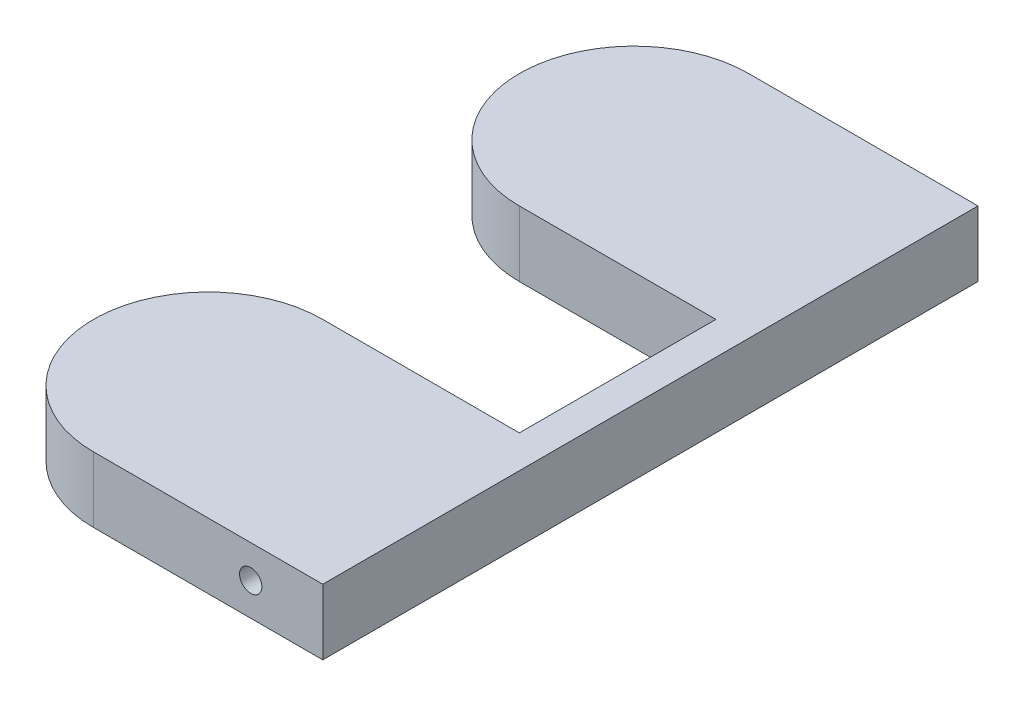
ISO-10303-21;
HEADER;
FILE_DESCRIPTION(('STEP AP214'),'2;1');
FILE_NAME('part.step','',(''),(''),'','','');
FILE_SCHEMA(('AUTOMOTIVE_DESIGN { 1 0 10303 214 1 1 1 1 }'));
ENDSEC;
DATA;
#1=APPLICATION_CONTEXT('core data for automotive mechanical design processes');
#2=APPLICATION_PROTOCOL_DEFINITION('international standard','automotive_design',2000,#1);
#3=PRODUCT_CONTEXT('',#1,'mechanical');
#4=PRODUCT('Part','Part','',(#3));
#5=PRODUCT_RELATED_PRODUCT_CATEGORY('part','',(#4));
#6=PRODUCT_DEFINITION_FORMATION('','',#4);
#7=PRODUCT_DEFINITION_CONTEXT('part definition',#1,'design');
#8=PRODUCT_DEFINITION('design','',#6,#7);
#9=PRODUCT_DEFINITION_SHAPE('','',#8);
#10=(LENGTH_UNIT() NAMED_UNIT(*) SI_UNIT(.MILLI.,.METRE.));
#11=(NAMED_UNIT(*) PLANE_ANGLE_UNIT() SI_UNIT($,.RADIAN.));
#12=(NAMED_UNIT(*) SI_UNIT($,.STERADIAN.) SOLID_ANGLE_UNIT());
#13=UNCERTAINTY_MEASURE_WITH_UNIT(LENGTH_MEASURE(1.E-05),#10,'distance_accuracy_value','');
#14=(GEOMETRIC_REPRESENTATION_CONTEXT(3) GLOBAL_UNCERTAINTY_ASSIGNED_CONTEXT((#13)) GLOBAL_UNIT_ASSIGNED_CONTEXT((#10,
#11,#12)) REPRESENTATION_CONTEXT('',''));
#15=CARTESIAN_POINT('',(0.,0.,0.));
#16=DIRECTION('',(0.,0.,1.));
#17=DIRECTION('',(1.,0.,0.));
#18=AXIS2_PLACEMENT_3D('',#15,#16,#17);
#19=CARTESIAN_POINT('',(-30.,0.,32.5));
#20=DIRECTION('',(0.,-1.,0.));
#21=DIRECTION('',(0.,0.,-1.));
#22=AXIS2_PLACEMENT_3D('',#19,#20,#21);
#23=PLANE('',#22);
#24=DIRECTION('',(1.,0.,0.));
#25=VECTOR('',#24,1.);
#26=CARTESIAN_POINT('',(5.00000000000001,0.,50.));
#27=LINE('',#26,#25);
#28=CARTESIAN_POINT('',(-30.,0.,50.));
#29=VERTEX_POINT('',#28);
#30=CARTESIAN_POINT('',(5.00000000000001,0.,50.));
#31=VERTEX_POINT('',#30);
#32=EDGE_CURVE('E216',#29,#31,#27,.T.);
#33=ORIENTED_EDGE('',*,*,#32,.F.);
#34=CARTESIAN_POINT('',(-30.,0.,32.5));
#35=DIRECTION('',(0.,1.,0.));
#36=DIRECTION('',(0.,0.,-1.));
#37=AXIS2_PLACEMENT_3D('',#34,#35,#36);
#38=CIRCLE('',#37,17.5);
#39=CARTESIAN_POINT('',(-30.,0.,15.));
#40=VERTEX_POINT('',#39);
#41=EDGE_CURVE('E221',#40,#29,#38,.T.);
#42=ORIENTED_EDGE('',*,*,#41,.F.);
#43=DIRECTION('',(-1.,0.,0.));
#44=VECTOR('',#43,1.);
#45=CARTESIAN_POINT('',(-30.,0.,15.));
#46=LINE('',#45,#44);
#47=CARTESIAN_POINT('',(0.,0.,15.));
#48=VERTEX_POINT('',#47);
#49=EDGE_CURVE('E248',#48,#40,#46,.T.);
#50=ORIENTED_EDGE('',*,*,#49,.F.);
#51=DIRECTION('',(0.,0.,1.));
#52=VECTOR('',#51,1.);
#53=CARTESIAN_POINT('',(0.,0.,15.));
#54=LINE('',#53,#52);
#55=CARTESIAN_POINT('',(0.,0.,-15.));
#56=VERTEX_POINT('',#55);
#57=EDGE_CURVE('E246',#56,#48,#54,.T.);
#58=ORIENTED_EDGE('',*,*,#57,.F.);
#59=DIRECTION('',(1.,0.,0.));
#60=VECTOR('',#59,1.);
#61=CARTESIAN_POINT('',(-30.,0.,-15.));
#62=LINE('',#61,#60);
#63=CARTESIAN_POINT('',(-30.,0.,-15.));
#64=VERTEX_POINT('',#63);
#65=EDGE_CURVE('E244',#64,#56,#62,.T.);
#66=ORIENTED_EDGE('',*,*,#65,.F.);
#67=CARTESIAN_POINT('',(-30.,0.,-32.5));
#68=DIRECTION('',(0.,1.,0.));
#69=DIRECTION('',(0.,0.,1.));
#70=AXIS2_PLACEMENT_3D('',#67,#68,#69);
#71=CIRCLE('',#70,17.5);
#72=CARTESIAN_POINT('',(-30.,0.,-50.));
#73=VERTEX_POINT('',#72);
#74=EDGE_CURVE('E242',#73,#64,#71,.T.);
#75=ORIENTED_EDGE('',*,*,#74,.F.);
#76=DIRECTION('',(-1.,0.,0.));
#77=VECTOR('',#76,1.);
#78=CARTESIAN_POINT('',(5.,0.,-50.));
#79=LINE('',#78,#77);
#80=CARTESIAN_POINT('',(5.,0.,-50.));
#81=VERTEX_POINT('',#80);
#82=EDGE_CURVE('E240',#81,#73,#79,.T.);
#83=ORIENTED_EDGE('',*,*,#82,.F.);
#84=DIRECTION('',(0.,0.,-1.));
#85=VECTOR('',#84,1.);
#86=CARTESIAN_POINT('',(5.,0.,-50.));
#87=LINE('',#86,#85);
#88=EDGE_CURVE('E238',#31,#81,#87,.T.);
#89=ORIENTED_EDGE('',*,*,#88,.F.);
#90=EDGE_LOOP('',(#33,#42,#50,#58,#66,#75,#83,#89));
#91=FACE_BOUND('',#90,.T.);
#92=DIRECTION('',(0.,0.,-1.));
#93=VECTOR('',#92,1.);
#94=CARTESIAN_POINT('',(-9.64999999999997,0.,43.));
#95=LINE('',#94,#93);
#96=CARTESIAN_POINT('',(-9.64999999999997,0.,43.));
#97=VERTEX_POINT('',#96);
#98=CARTESIAN_POINT('',(-9.64999999999997,0.,35.));
#99=VERTEX_POINT('',#98);
#100=EDGE_CURVE('E210',#97,#99,#95,.T.);
#101=ORIENTED_EDGE('',*,*,#100,.F.);
#102=DIRECTION('',(1.,0.,0.));
#103=VECTOR('',#102,1.);
#104=CARTESIAN_POINT('',(-9.64999999999997,0.,43.));
#105=LINE('',#104,#103);
#106=CARTESIAN_POINT('',(-2.34999999999997,0.,43.));
#107=VERTEX_POINT('',#106);
#108=EDGE_CURVE('E187',#97,#107,#105,.T.);
#109=ORIENTED_EDGE('',*,*,#108,.T.);
#110=DIRECTION('',(0.,0.,-1.));
#111=VECTOR('',#110,1.);
#112=CARTESIAN_POINT('',(-2.34999999999997,0.,43.));
#113=LINE('',#112,#111);
#114=CARTESIAN_POINT('',(-2.34999999999997,0.,35.));
#115=VERTEX_POINT('',#114);
#116=EDGE_CURVE('E207',#107,#115,#113,.T.);
#117=ORIENTED_EDGE('',*,*,#116,.T.);
#118=DIRECTION('',(1.,0.,0.));
#119=VECTOR('',#118,1.);
#120=CARTESIAN_POINT('',(-9.64999999999997,0.,35.));
#121=LINE('',#120,#119);
#122=EDGE_CURVE('E197',#99,#115,#121,.T.);
#123=ORIENTED_EDGE('',*,*,#122,.F.);
#124=EDGE_LOOP('',(#101,#109,#117,#123));
#125=FACE_BOUND('',#124,.T.);
#126=DIRECTION('',(0.,0.,1.));
#127=VECTOR('',#126,1.);
#128=CARTESIAN_POINT('',(-2.34999999999997,0.,-43.));
#129=LINE('',#128,#127);
#130=CARTESIAN_POINT('',(-2.34999999999997,0.,-43.));
#131=VERTEX_POINT('',#130);
#132=CARTESIAN_POINT('',(-2.34999999999997,0.,-35.));
#133=VERTEX_POINT('',#132);
#134=EDGE_CURVE('E51',#131,#133,#129,.T.);
#135=ORIENTED_EDGE('',*,*,#134,.F.);
#136=DIRECTION('',(-1.,0.,0.));
#137=VECTOR('',#136,1.);
#138=CARTESIAN_POINT('',(-9.64999999999997,0.,-43.));
#139=LINE('',#138,#137);
#140=CARTESIAN_POINT('',(-9.64999999999997,0.,-43.));
#141=VERTEX_POINT('',#140);
#142=EDGE_CURVE('E397',#131,#141,#139,.T.);
#143=ORIENTED_EDGE('',*,*,#142,.T.);
#144=DIRECTION('',(0.,0.,1.));
#145=VECTOR('',#144,1.);
#146=CARTESIAN_POINT('',(-9.64999999999997,0.,-43.));
#147=LINE('',#146,#145);
#148=CARTESIAN_POINT('',(-9.64999999999997,0.,-35.));
#149=VERTEX_POINT('',#148);
#150=EDGE_CURVE('E170',#141,#149,#147,.T.);
#151=ORIENTED_EDGE('',*,*,#150,.T.);
#152=DIRECTION('',(-1.,0.,0.));
#153=VECTOR('',#152,1.);
#154=CARTESIAN_POINT('',(-9.64999999999997,0.,-35.));
#155=LINE('',#154,#153);
#156=EDGE_CURVE('E171',#133,#149,#155,.T.);
#157=ORIENTED_EDGE('',*,*,#156,.F.);
#158=EDGE_LOOP('',(#135,#143,#151,#157));
#159=FACE_BOUND('',#158,.T.);
#160=ADVANCED_FACE('F34',(#91,#125,#159),#23,.T.);
#161=CARTESIAN_POINT('',(-5.99999999999999,5.,-35.));
#162=DIRECTION('',(0.,0.,-1.));
#163=DIRECTION('',(-1.,0.,0.));
#164=AXIS2_PLACEMENT_3D('',#161,#162,#163);
#165=CYLINDRICAL_SURFACE('',#164,1.705);
#166=CARTESIAN_POINT('',(-5.99999999999999,5.,-50.));
#167=DIRECTION('',(0.,0.,-1.));
#168=DIRECTION('',(-1.,0.,0.));
#169=AXIS2_PLACEMENT_3D('',#166,#167,#168);
#170=CIRCLE('',#169,1.705);
#171=CARTESIAN_POINT('',(-7.70499999999999,5.,-50.));
#172=VERTEX_POINT('',#171);
#173=EDGE_CURVE('E178',#172,#172,#170,.T.);
#174=ORIENTED_EDGE('',*,*,#173,.T.);
#175=EDGE_LOOP('',(#174));
#176=FACE_BOUND('',#175,.T.);
#177=CARTESIAN_POINT('',(-5.99999999999999,5.,-43.));
#178=DIRECTION('',(0.,0.,1.));
#179=DIRECTION('',(1.,0.,0.));
#180=AXIS2_PLACEMENT_3D('',#177,#178,#179);
#181=CIRCLE('',#180,1.705);
#182=CARTESIAN_POINT('',(-4.29499999999999,5.,-43.));
#183=VERTEX_POINT('',#182);
#184=EDGE_CURVE('E38',#183,#183,#181,.F.);
#185=ORIENTED_EDGE('',*,*,#184,.F.);
#186=EDGE_LOOP('',(#185));
#187=FACE_BOUND('',#186,.T.);
#188=ADVANCED_FACE('F276',(#176,#187),#165,.F.);
#189=CARTESIAN_POINT('',(-5.99999999999999,5.,35.));
#190=DIRECTION('',(0.,0.,1.));
#191=DIRECTION('',(1.,0.,0.));
#192=AXIS2_PLACEMENT_3D('',#189,#190,#191);
#193=CYLINDRICAL_SURFACE('',#192,1.705);
#194=CARTESIAN_POINT('',(-5.99999999999999,5.,50.));
#195=DIRECTION('',(0.,0.,1.));
#196=DIRECTION('',(1.,0.,0.));
#197=AXIS2_PLACEMENT_3D('',#194,#195,#196);
#198=CIRCLE('',#197,1.705);
#199=CARTESIAN_POINT('',(-4.29499999999999,5.,50.));
#200=VERTEX_POINT('',#199);
#201=EDGE_CURVE('E213',#200,#200,#198,.T.);
#202=ORIENTED_EDGE('',*,*,#201,.T.);
#203=EDGE_LOOP('',(#202));
#204=FACE_BOUND('',#203,.T.);
#205=CARTESIAN_POINT('',(-5.99999999999999,5.,43.));
#206=DIRECTION('',(0.,0.,-1.));
#207=DIRECTION('',(-1.,0.,0.));
#208=AXIS2_PLACEMENT_3D('',#205,#206,#207);
#209=CIRCLE('',#208,1.705);
#210=CARTESIAN_POINT('',(-7.70499999999999,5.,43.));
#211=VERTEX_POINT('',#210);
#212=EDGE_CURVE('E212',#211,#211,#209,.F.);
#213=ORIENTED_EDGE('',*,*,#212,.F.);
#214=EDGE_LOOP('',(#213));
#215=FACE_BOUND('',#214,.T.);
#216=ADVANCED_FACE('F274',(#204,#215),#193,.F.);
#217=CARTESIAN_POINT('',(5.00000000000001,10.,50.));
#218=DIRECTION('',(0.,0.,-1.));
#219=DIRECTION('',(-1.,0.,0.));
#220=AXIS2_PLACEMENT_3D('',#217,#218,#219);
#221=PLANE('',#220);
#222=ORIENTED_EDGE('',*,*,#201,.F.);
#223=EDGE_LOOP('',(#222));
#224=FACE_BOUND('',#223,.T.);
#225=ORIENTED_EDGE('',*,*,#32,.T.);
#226=DIRECTION('',(0.,-1.,0.));
#227=VECTOR('',#226,1.);
#228=CARTESIAN_POINT('',(5.00000000000001,10.,50.));
#229=LINE('',#228,#227);
#230=CARTESIAN_POINT('',(5.00000000000001,10.,50.));
#231=VERTEX_POINT('',#230);
#232=EDGE_CURVE('E11',#231,#31,#229,.T.);
#233=ORIENTED_EDGE('',*,*,#232,.F.);
#234=DIRECTION('',(1.,0.,0.));
#235=VECTOR('',#234,1.);
#236=CARTESIAN_POINT('',(5.00000000000001,10.,50.));
#237=LINE('',#236,#235);
#238=CARTESIAN_POINT('',(-30.,10.,50.));
#239=VERTEX_POINT('',#238);
#240=EDGE_CURVE('E217',#239,#231,#237,.T.);
#241=ORIENTED_EDGE('',*,*,#240,.F.);
#242=DIRECTION('',(0.,-1.,0.));
#243=VECTOR('',#242,1.);
#244=CARTESIAN_POINT('',(-30.,10.,50.));
#245=LINE('',#244,#243);
#246=EDGE_CURVE('E235',#239,#29,#245,.T.);
#247=ORIENTED_EDGE('',*,*,#246,.T.);
#248=EDGE_LOOP('',(#225,#233,#241,#247));
#249=FACE_BOUND('',#248,.T.);
#250=ADVANCED_FACE('F36',(#224,#249),#221,.F.);
#251=CARTESIAN_POINT('',(5.,10.,-50.));
#252=DIRECTION('',(-1.,0.,0.));
#253=DIRECTION('',(0.,0.,1.));
#254=AXIS2_PLACEMENT_3D('',#251,#252,#253);
#255=PLANE('',#254);
#256=ORIENTED_EDGE('',*,*,#88,.T.);
#257=DIRECTION('',(0.,-1.,0.));
#258=VECTOR('',#257,1.);
#259=CARTESIAN_POINT('',(5.,10.,-50.));
#260=LINE('',#259,#258);
#261=CARTESIAN_POINT('',(5.,10.,-50.));
#262=VERTEX_POINT('',#261);
#263=EDGE_CURVE('E43',#262,#81,#260,.T.);
#264=ORIENTED_EDGE('',*,*,#263,.F.);
#265=DIRECTION('',(0.,0.,-1.));
#266=VECTOR('',#265,1.);
#267=CARTESIAN_POINT('',(5.,10.,-50.));
#268=LINE('',#267,#266);
#269=EDGE_CURVE('E220',#231,#262,#268,.T.);
#270=ORIENTED_EDGE('',*,*,#269,.F.);
#271=ORIENTED_EDGE('',*,*,#232,.T.);
#272=EDGE_LOOP('',(#256,#264,#270,#271));
#273=FACE_BOUND('',#272,.T.);
#274=ADVANCED_FACE('F283',(#273),#255,.F.);
#275=CARTESIAN_POINT('',(5.,10.,-50.));
#276=DIRECTION('',(0.,0.,1.));
#277=DIRECTION('',(1.,0.,0.));
#278=AXIS2_PLACEMENT_3D('',#275,#276,#277);
#279=PLANE('',#278);
#280=ORIENTED_EDGE('',*,*,#173,.F.);
#281=EDGE_LOOP('',(#280));
#282=FACE_BOUND('',#281,.T.);
#283=ORIENTED_EDGE('',*,*,#82,.T.);
#284=DIRECTION('',(0.,-1.,0.));
#285=VECTOR('',#284,1.);
#286=CARTESIAN_POINT('',(-30.,10.,-50.));
#287=LINE('',#286,#285);
#288=CARTESIAN_POINT('',(-30.,10.,-50.));
#289=VERTEX_POINT('',#288);
#290=EDGE_CURVE('E265',#289,#73,#287,.T.);
#291=ORIENTED_EDGE('',*,*,#290,.F.);
#292=DIRECTION('',(-1.,0.,0.));
#293=VECTOR('',#292,1.);
#294=CARTESIAN_POINT('',(5.,10.,-50.));
#295=LINE('',#294,#293);
#296=EDGE_CURVE('E223',#262,#289,#295,.T.);
#297=ORIENTED_EDGE('',*,*,#296,.F.);
#298=ORIENTED_EDGE('',*,*,#263,.T.);
#299=EDGE_LOOP('',(#283,#291,#297,#298));
#300=FACE_BOUND('',#299,.T.);
#301=ADVANCED_FACE('F317',(#282,#300),#279,.F.);
#302=CARTESIAN_POINT('',(-30.,10.,-32.5));
#303=DIRECTION('',(0.,-1.,0.));
#304=DIRECTION('',(0.,0.,-1.));
#305=AXIS2_PLACEMENT_3D('',#302,#303,#304);
#306=CYLINDRICAL_SURFACE('',#305,17.5);
#307=ORIENTED_EDGE('',*,*,#74,.T.);
#308=DIRECTION('',(0.,-1.,0.));
#309=VECTOR('',#308,1.);
#310=CARTESIAN_POINT('',(-30.,10.,-15.));
#311=LINE('',#310,#309);
#312=CARTESIAN_POINT('',(-30.,10.,-15.));
#313=VERTEX_POINT('',#312);
#314=EDGE_CURVE('E262',#313,#64,#311,.T.);
#315=ORIENTED_EDGE('',*,*,#314,.F.);
#316=CARTESIAN_POINT('',(-30.,10.,-32.5));
#317=DIRECTION('',(0.,1.,0.));
#318=DIRECTION('',(0.,0.,1.));
#319=AXIS2_PLACEMENT_3D('',#316,#317,#318);
#320=CIRCLE('',#319,17.5);
#321=EDGE_CURVE('E225',#289,#313,#320,.T.);
#322=ORIENTED_EDGE('',*,*,#321,.F.);
#323=ORIENTED_EDGE('',*,*,#290,.T.);
#324=EDGE_LOOP('',(#307,#315,#322,#323));
#325=FACE_BOUND('',#324,.T.);
#326=ADVANCED_FACE('F313',(#325),#306,.T.);
#327=CARTESIAN_POINT('',(-30.,10.,-15.));
#328=DIRECTION('',(0.,0.,-1.));
#329=DIRECTION('',(-1.,0.,0.));
#330=AXIS2_PLACEMENT_3D('',#327,#328,#329);
#331=PLANE('',#330);
#332=ORIENTED_EDGE('',*,*,#65,.T.);
#333=DIRECTION('',(0.,-1.,0.));
#334=VECTOR('',#333,1.);
#335=CARTESIAN_POINT('',(0.,10.,-15.));
#336=LINE('',#335,#334);
#337=CARTESIAN_POINT('',(0.,10.,-15.));
#338=VERTEX_POINT('',#337);
#339=EDGE_CURVE('E259',#338,#56,#336,.T.);
#340=ORIENTED_EDGE('',*,*,#339,.F.);
#341=DIRECTION('',(1.,0.,0.));
#342=VECTOR('',#341,1.);
#343=CARTESIAN_POINT('',(-30.,10.,-15.));
#344=LINE('',#343,#342);
#345=EDGE_CURVE('E227',#313,#338,#344,.T.);
#346=ORIENTED_EDGE('',*,*,#345,.F.);
#347=ORIENTED_EDGE('',*,*,#314,.T.);
#348=EDGE_LOOP('',(#332,#340,#346,#347));
#349=FACE_BOUND('',#348,.T.);
#350=ADVANCED_FACE('F309',(#349),#331,.F.);
#351=CARTESIAN_POINT('',(0.,10.,15.));
#352=DIRECTION('',(1.,0.,0.));
#353=DIRECTION('',(0.,0.,-1.));
#354=AXIS2_PLACEMENT_3D('',#351,#352,#353);
#355=PLANE('',#354);
#356=ORIENTED_EDGE('',*,*,#57,.T.);
#357=DIRECTION('',(0.,-1.,0.));
#358=VECTOR('',#357,1.);
#359=CARTESIAN_POINT('',(0.,10.,15.));
#360=LINE('',#359,#358);
#361=CARTESIAN_POINT('',(0.,10.,15.));
#362=VERTEX_POINT('',#361);
#363=EDGE_CURVE('E256',#362,#48,#360,.T.);
#364=ORIENTED_EDGE('',*,*,#363,.F.);
#365=DIRECTION('',(0.,0.,1.));
#366=VECTOR('',#365,1.);
#367=CARTESIAN_POINT('',(0.,10.,15.));
#368=LINE('',#367,#366);
#369=EDGE_CURVE('E229',#338,#362,#368,.T.);
#370=ORIENTED_EDGE('',*,*,#369,.F.);
#371=ORIENTED_EDGE('',*,*,#339,.T.);
#372=EDGE_LOOP('',(#356,#364,#370,#371));
#373=FACE_BOUND('',#372,.T.);
#374=ADVANCED_FACE('F305',(#373),#355,.F.);
#375=CARTESIAN_POINT('',(-30.,10.,15.));
#376=DIRECTION('',(0.,0.,1.));
#377=DIRECTION('',(1.,0.,0.));
#378=AXIS2_PLACEMENT_3D('',#375,#376,#377);
#379=PLANE('',#378);
#380=ORIENTED_EDGE('',*,*,#49,.T.);
#381=DIRECTION('',(0.,-1.,0.));
#382=VECTOR('',#381,1.);
#383=CARTESIAN_POINT('',(-30.,10.,15.));
#384=LINE('',#383,#382);
#385=CARTESIAN_POINT('',(-30.,10.,15.));
#386=VERTEX_POINT('',#385);
#387=EDGE_CURVE('E253',#386,#40,#384,.T.);
#388=ORIENTED_EDGE('',*,*,#387,.F.);
#389=DIRECTION('',(-1.,0.,0.));
#390=VECTOR('',#389,1.);
#391=CARTESIAN_POINT('',(-30.,10.,15.));
#392=LINE('',#391,#390);
#393=EDGE_CURVE('E231',#362,#386,#392,.T.);
#394=ORIENTED_EDGE('',*,*,#393,.F.);
#395=ORIENTED_EDGE('',*,*,#363,.T.);
#396=EDGE_LOOP('',(#380,#388,#394,#395));
#397=FACE_BOUND('',#396,.T.);
#398=ADVANCED_FACE('F301',(#397),#379,.F.);
#399=CARTESIAN_POINT('',(-30.,10.,32.5));
#400=DIRECTION('',(0.,-1.,0.));
#401=DIRECTION('',(0.,0.,-1.));
#402=AXIS2_PLACEMENT_3D('',#399,#400,#401);
#403=CYLINDRICAL_SURFACE('',#402,17.5);
#404=ORIENTED_EDGE('',*,*,#41,.T.);
#405=ORIENTED_EDGE('',*,*,#246,.F.);
#406=CARTESIAN_POINT('',(-30.,10.,32.5));
#407=DIRECTION('',(0.,1.,0.));
#408=DIRECTION('',(0.,0.,-1.));
#409=AXIS2_PLACEMENT_3D('',#406,#407,#408);
#410=CIRCLE('',#409,17.5);
#411=EDGE_CURVE('E233',#386,#239,#410,.T.);
#412=ORIENTED_EDGE('',*,*,#411,.F.);
#413=ORIENTED_EDGE('',*,*,#387,.T.);
#414=EDGE_LOOP('',(#404,#405,#412,#413));
#415=FACE_BOUND('',#414,.T.);
#416=ADVANCED_FACE('F298',(#415),#403,.T.);
#417=CARTESIAN_POINT('',(-30.,10.,32.5));
#418=DIRECTION('',(0.,-1.,0.));
#419=DIRECTION('',(0.,0.,-1.));
#420=AXIS2_PLACEMENT_3D('',#417,#418,#419);
#421=PLANE('',#420);
#422=ORIENTED_EDGE('',*,*,#240,.T.);
#423=ORIENTED_EDGE('',*,*,#269,.T.);
#424=ORIENTED_EDGE('',*,*,#296,.T.);
#425=ORIENTED_EDGE('',*,*,#321,.T.);
#426=ORIENTED_EDGE('',*,*,#345,.T.);
#427=ORIENTED_EDGE('',*,*,#369,.T.);
#428=ORIENTED_EDGE('',*,*,#393,.T.);
#429=ORIENTED_EDGE('',*,*,#411,.T.);
#430=EDGE_LOOP('',(#422,#423,#424,#425,#426,#427,#428,#429));
#431=FACE_BOUND('',#430,.T.);
#432=ADVANCED_FACE('F297',(#431),#421,.F.);
#433=CARTESIAN_POINT('',(0.,0.,43.));
#434=DIRECTION('',(0.,0.,-1.));
#435=DIRECTION('',(-1.,0.,0.));
#436=AXIS2_PLACEMENT_3D('',#433,#434,#435);
#437=PLANE('',#436);
#438=DIRECTION('',(0.,-1.,0.));
#439=VECTOR('',#438,1.);
#440=CARTESIAN_POINT('',(-9.64999999999997,0.,43.));
#441=LINE('',#440,#439);
#442=CARTESIAN_POINT('',(-9.64999999999997,8.65,43.));
#443=VERTEX_POINT('',#442);
#444=EDGE_CURVE('E184',#443,#97,#441,.T.);
#445=ORIENTED_EDGE('',*,*,#444,.F.);
#446=DIRECTION('',(-1.,0.,0.));
#447=VECTOR('',#446,1.);
#448=CARTESIAN_POINT('',(-9.64999999999997,8.65,43.));
#449=LINE('',#448,#447);
#450=CARTESIAN_POINT('',(-2.34999999999997,8.65,43.));
#451=VERTEX_POINT('',#450);
#452=EDGE_CURVE('E193',#451,#443,#449,.T.);
#453=ORIENTED_EDGE('',*,*,#452,.F.);
#454=DIRECTION('',(0.,1.,0.));
#455=VECTOR('',#454,1.);
#456=CARTESIAN_POINT('',(-2.34999999999997,0.,43.));
#457=LINE('',#456,#455);
#458=EDGE_CURVE('E191',#107,#451,#457,.T.);
#459=ORIENTED_EDGE('',*,*,#458,.F.);
#460=ORIENTED_EDGE('',*,*,#108,.F.);
#461=EDGE_LOOP('',(#445,#453,#459,#460));
#462=FACE_BOUND('',#461,.T.);
#463=ORIENTED_EDGE('',*,*,#212,.T.);
#464=EDGE_LOOP('',(#463));
#465=FACE_BOUND('',#464,.T.);
#466=ADVANCED_FACE('F272',(#462,#465),#437,.T.);
#467=CARTESIAN_POINT('',(-9.64999999999997,0.,43.));
#468=DIRECTION('',(1.,0.,0.));
#469=DIRECTION('',(0.,0.,-1.));
#470=AXIS2_PLACEMENT_3D('',#467,#468,#469);
#471=PLANE('',#470);
#472=DIRECTION('',(0.,-1.,0.));
#473=VECTOR('',#472,1.);
#474=CARTESIAN_POINT('',(-9.64999999999997,0.,35.));
#475=LINE('',#474,#473);
#476=CARTESIAN_POINT('',(-9.64999999999997,8.65,35.));
#477=VERTEX_POINT('',#476);
#478=EDGE_CURVE('E59',#477,#99,#475,.T.);
#479=ORIENTED_EDGE('',*,*,#478,.F.);
#480=DIRECTION('',(0.,0.,-1.));
#481=VECTOR('',#480,1.);
#482=CARTESIAN_POINT('',(-9.64999999999997,8.65,43.));
#483=LINE('',#482,#481);
#484=EDGE_CURVE('E195',#443,#477,#483,.T.);
#485=ORIENTED_EDGE('',*,*,#484,.F.);
#486=ORIENTED_EDGE('',*,*,#444,.T.);
#487=ORIENTED_EDGE('',*,*,#100,.T.);
#488=EDGE_LOOP('',(#479,#485,#486,#487));
#489=FACE_BOUND('',#488,.T.);
#490=ADVANCED_FACE('F353',(#489),#471,.T.);
#491=CARTESIAN_POINT('',(-2.34999999999997,0.,43.));
#492=DIRECTION('',(-1.,0.,0.));
#493=DIRECTION('',(0.,0.,1.));
#494=AXIS2_PLACEMENT_3D('',#491,#492,#493);
#495=PLANE('',#494);
#496=DIRECTION('',(0.,1.,0.));
#497=VECTOR('',#496,1.);
#498=CARTESIAN_POINT('',(-2.34999999999997,0.,35.));
#499=LINE('',#498,#497);
#500=CARTESIAN_POINT('',(-2.34999999999997,8.65,35.));
#501=VERTEX_POINT('',#500);
#502=EDGE_CURVE('E199',#115,#501,#499,.T.);
#503=ORIENTED_EDGE('',*,*,#502,.F.);
#504=ORIENTED_EDGE('',*,*,#116,.F.);
#505=ORIENTED_EDGE('',*,*,#458,.T.);
#506=DIRECTION('',(0.,0.,-1.));
#507=VECTOR('',#506,1.);
#508=CARTESIAN_POINT('',(-2.34999999999997,8.65,43.));
#509=LINE('',#508,#507);
#510=EDGE_CURVE('E204',#451,#501,#509,.T.);
#511=ORIENTED_EDGE('',*,*,#510,.T.);
#512=EDGE_LOOP('',(#503,#504,#505,#511));
#513=FACE_BOUND('',#512,.T.);
#514=ADVANCED_FACE('F359',(#513),#495,.T.);
#515=CARTESIAN_POINT('',(-9.64999999999997,8.65,43.));
#516=DIRECTION('',(0.,-1.,0.));
#517=DIRECTION('',(0.,0.,-1.));
#518=AXIS2_PLACEMENT_3D('',#515,#516,#517);
#519=PLANE('',#518);
#520=DIRECTION('',(-1.,0.,0.));
#521=VECTOR('',#520,1.);
#522=CARTESIAN_POINT('',(-9.64999999999997,8.65,35.));
#523=LINE('',#522,#521);
#524=EDGE_CURVE('E188',#501,#477,#523,.T.);
#525=ORIENTED_EDGE('',*,*,#524,.F.);
#526=ORIENTED_EDGE('',*,*,#510,.F.);
#527=ORIENTED_EDGE('',*,*,#452,.T.);
#528=ORIENTED_EDGE('',*,*,#484,.T.);
#529=EDGE_LOOP('',(#525,#526,#527,#528));
#530=FACE_BOUND('',#529,.T.);
#531=ADVANCED_FACE('F365',(#530),#519,.T.);
#532=CARTESIAN_POINT('',(-5.99999999999999,5.,35.));
#533=DIRECTION('',(0.,0.,1.));
#534=DIRECTION('',(1.,0.,0.));
#535=AXIS2_PLACEMENT_3D('',#532,#533,#534);
#536=PLANE('',#535);
#537=ORIENTED_EDGE('',*,*,#478,.T.);
#538=ORIENTED_EDGE('',*,*,#122,.T.);
#539=ORIENTED_EDGE('',*,*,#502,.T.);
#540=ORIENTED_EDGE('',*,*,#524,.T.);
#541=EDGE_LOOP('',(#537,#538,#539,#540));
#542=FACE_BOUND('',#541,.T.);
#543=ADVANCED_FACE('F368',(#542),#536,.T.);
#544=CARTESIAN_POINT('',(0.,0.,-43.));
#545=DIRECTION('',(0.,0.,1.));
#546=DIRECTION('',(1.,0.,0.));
#547=AXIS2_PLACEMENT_3D('',#544,#545,#546);
#548=PLANE('',#547);
#549=DIRECTION('',(0.,1.,0.));
#550=VECTOR('',#549,1.);
#551=CARTESIAN_POINT('',(-9.64999999999997,8.65,-43.));
#552=LINE('',#551,#550);
#553=CARTESIAN_POINT('',(-9.64999999999997,8.65,-43.));
#554=VERTEX_POINT('',#553);
#555=EDGE_CURVE('E155',#141,#554,#552,.T.);
#556=ORIENTED_EDGE('',*,*,#555,.F.);
#557=ORIENTED_EDGE('',*,*,#142,.F.);
#558=DIRECTION('',(0.,-1.,0.));
#559=VECTOR('',#558,1.);
#560=CARTESIAN_POINT('',(-2.34999999999997,8.65,-43.));
#561=LINE('',#560,#559);
#562=CARTESIAN_POINT('',(-2.34999999999997,8.65,-43.));
#563=VERTEX_POINT('',#562);
#564=EDGE_CURVE('E157',#563,#131,#561,.T.);
#565=ORIENTED_EDGE('',*,*,#564,.F.);
#566=DIRECTION('',(1.,0.,0.));
#567=VECTOR('',#566,1.);
#568=CARTESIAN_POINT('',(-9.64999999999997,8.65,-43.));
#569=LINE('',#568,#567);
#570=EDGE_CURVE('E150',#554,#563,#569,.T.);
#571=ORIENTED_EDGE('',*,*,#570,.F.);
#572=EDGE_LOOP('',(#556,#557,#565,#571));
#573=FACE_BOUND('',#572,.T.);
#574=ORIENTED_EDGE('',*,*,#184,.T.);
#575=EDGE_LOOP('',(#574));
#576=FACE_BOUND('',#575,.T.);
#577=ADVANCED_FACE('F152',(#573,#576),#548,.T.);
#578=CARTESIAN_POINT('',(-9.64999999999997,8.65,-43.));
#579=DIRECTION('',(1.,0.,0.));
#580=DIRECTION('',(0.,0.,-1.));
#581=AXIS2_PLACEMENT_3D('',#578,#579,#580);
#582=PLANE('',#581);
#583=DIRECTION('',(0.,1.,0.));
#584=VECTOR('',#583,1.);
#585=CARTESIAN_POINT('',(-9.64999999999997,8.65,-35.));
#586=LINE('',#585,#584);
#587=CARTESIAN_POINT('',(-9.64999999999997,8.65,-35.));
#588=VERTEX_POINT('',#587);
#589=EDGE_CURVE('E391',#149,#588,#586,.T.);
#590=ORIENTED_EDGE('',*,*,#589,.F.);
#591=ORIENTED_EDGE('',*,*,#150,.F.);
#592=ORIENTED_EDGE('',*,*,#555,.T.);
#593=DIRECTION('',(0.,0.,1.));
#594=VECTOR('',#593,1.);
#595=CARTESIAN_POINT('',(-9.64999999999997,8.65,-43.));
#596=LINE('',#595,#594);
#597=EDGE_CURVE('E167',#554,#588,#596,.T.);
#598=ORIENTED_EDGE('',*,*,#597,.T.);
#599=EDGE_LOOP('',(#590,#591,#592,#598));
#600=FACE_BOUND('',#599,.T.);
#601=ADVANCED_FACE('F166',(#600),#582,.T.);
#602=CARTESIAN_POINT('',(-9.64999999999997,8.65,-43.));
#603=DIRECTION('',(0.,-1.,0.));
#604=DIRECTION('',(1.,0.,0.));
#605=AXIS2_PLACEMENT_3D('',#602,#603,#604);
#606=PLANE('',#605);
#607=DIRECTION('',(1.,0.,0.));
#608=VECTOR('',#607,1.);
#609=CARTESIAN_POINT('',(-9.64999999999997,8.65,-35.));
#610=LINE('',#609,#608);
#611=CARTESIAN_POINT('',(-2.34999999999997,8.65,-35.));
#612=VERTEX_POINT('',#611);
#613=EDGE_CURVE('E174',#588,#612,#610,.T.);
#614=ORIENTED_EDGE('',*,*,#613,.F.);
#615=ORIENTED_EDGE('',*,*,#597,.F.);
#616=ORIENTED_EDGE('',*,*,#570,.T.);
#617=DIRECTION('',(0.,0.,1.));
#618=VECTOR('',#617,1.);
#619=CARTESIAN_POINT('',(-2.34999999999997,8.65,-43.));
#620=LINE('',#619,#618);
#621=EDGE_CURVE('E175',#563,#612,#620,.T.);
#622=ORIENTED_EDGE('',*,*,#621,.T.);
#623=EDGE_LOOP('',(#614,#615,#616,#622));
#624=FACE_BOUND('',#623,.T.);
#625=ADVANCED_FACE('F173',(#624),#606,.T.);
#626=CARTESIAN_POINT('',(-2.34999999999997,8.65,-43.));
#627=DIRECTION('',(-1.,0.,0.));
#628=DIRECTION('',(0.,0.,1.));
#629=AXIS2_PLACEMENT_3D('',#626,#627,#628);
#630=PLANE('',#629);
#631=DIRECTION('',(0.,-1.,0.));
#632=VECTOR('',#631,1.);
#633=CARTESIAN_POINT('',(-2.34999999999997,8.65,-35.));
#634=LINE('',#633,#632);
#635=EDGE_CURVE('E394',#612,#133,#634,.T.);
#636=ORIENTED_EDGE('',*,*,#635,.F.);
#637=ORIENTED_EDGE('',*,*,#621,.F.);
#638=ORIENTED_EDGE('',*,*,#564,.T.);
#639=ORIENTED_EDGE('',*,*,#134,.T.);
#640=EDGE_LOOP('',(#636,#637,#638,#639));
#641=FACE_BOUND('',#640,.T.);
#642=ADVANCED_FACE('F382',(#641),#630,.T.);
#643=CARTESIAN_POINT('',(-5.99999999999999,5.,-35.));
#644=DIRECTION('',(0.,0.,-1.));
#645=DIRECTION('',(-1.,0.,0.));
#646=AXIS2_PLACEMENT_3D('',#643,#644,#645);
#647=PLANE('',#646);
#648=ORIENTED_EDGE('',*,*,#589,.T.);
#649=ORIENTED_EDGE('',*,*,#613,.T.);
#650=ORIENTED_EDGE('',*,*,#635,.T.);
#651=ORIENTED_EDGE('',*,*,#156,.T.);
#652=EDGE_LOOP('',(#648,#649,#650,#651));
#653=FACE_BOUND('',#652,.T.);
#654=ADVANCED_FACE('F385',(#653),#647,.T.);
#655=CLOSED_SHELL('',(#160,#188,#216,#250,#274,#301,#326,#350,#374,#398,#416,#432,#466,#490,
#514,#531,#543,#577,#601,#625,#642,#654));
#656=MANIFOLD_SOLID_BREP('B2',#655);
#657=ADVANCED_BREP_SHAPE_REPRESENTATION('',(#18,#656),#14);
#658=SHAPE_DEFINITION_REPRESENTATION(#9,#657);
ENDSEC;
END-ISO-10303-21;
